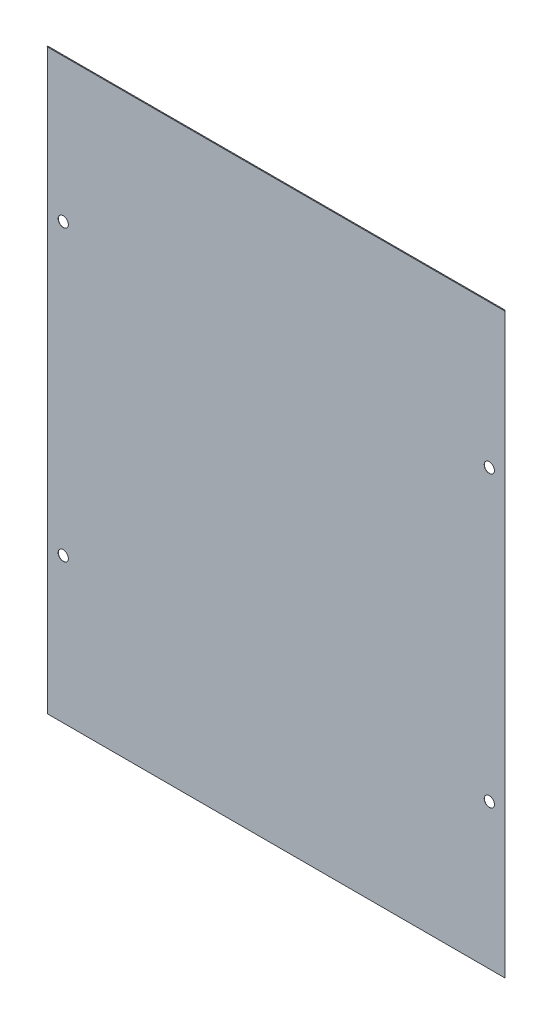
ISO-10303-21;
HEADER;
FILE_DESCRIPTION(('STEP AP214'),'2;1');
FILE_NAME('part.step','',(''),(''),'','','');
FILE_SCHEMA(('AUTOMOTIVE_DESIGN { 1 0 10303 214 1 1 1 1 }'));
ENDSEC;
DATA;
#1=APPLICATION_CONTEXT('core data for automotive mechanical design processes');
#2=APPLICATION_PROTOCOL_DEFINITION('international standard','automotive_design',2000,#1);
#3=PRODUCT_CONTEXT('',#1,'mechanical');
#4=PRODUCT('Part','Part','',(#3));
#5=PRODUCT_RELATED_PRODUCT_CATEGORY('part','',(#4));
#6=PRODUCT_DEFINITION_FORMATION('','',#4);
#7=PRODUCT_DEFINITION_CONTEXT('part definition',#1,'design');
#8=PRODUCT_DEFINITION('design','',#6,#7);
#9=PRODUCT_DEFINITION_SHAPE('','',#8);
#10=(LENGTH_UNIT() NAMED_UNIT(*) SI_UNIT(.MILLI.,.METRE.));
#11=(NAMED_UNIT(*) PLANE_ANGLE_UNIT() SI_UNIT($,.RADIAN.));
#12=(NAMED_UNIT(*) SI_UNIT($,.STERADIAN.) SOLID_ANGLE_UNIT());
#13=UNCERTAINTY_MEASURE_WITH_UNIT(LENGTH_MEASURE(1.E-05),#10,'distance_accuracy_value','');
#14=(GEOMETRIC_REPRESENTATION_CONTEXT(3) GLOBAL_UNCERTAINTY_ASSIGNED_CONTEXT((#13)) GLOBAL_UNIT_ASSIGNED_CONTEXT((#10,
#11,#12)) REPRESENTATION_CONTEXT('',''));
#15=CARTESIAN_POINT('',(0.,0.,0.));
#16=DIRECTION('',(0.,0.,1.));
#17=DIRECTION('',(1.,0.,0.));
#18=AXIS2_PLACEMENT_3D('',#15,#16,#17);
#19=CARTESIAN_POINT('',(0.,113.6448,0.06858));
#20=DIRECTION('',(0.,1.,0.));
#21=DIRECTION('',(0.,0.,1.));
#22=AXIS2_PLACEMENT_3D('',#19,#20,#21);
#23=PLANE('',#22);
#24=DIRECTION('',(1.,0.,0.));
#25=VECTOR('',#24,1.);
#26=CARTESIAN_POINT('',(0.,113.6448,0.));
#27=LINE('',#26,#25);
#28=CARTESIAN_POINT('',(-89.8724,113.6448,0.));
#29=VERTEX_POINT('',#28);
#30=CARTESIAN_POINT('',(89.8724,113.6448,0.));
#31=VERTEX_POINT('',#30);
#32=EDGE_CURVE('E155',#29,#31,#27,.T.);
#33=ORIENTED_EDGE('',*,*,#32,.F.);
#34=DIRECTION('',(0.,0.,-1.));
#35=VECTOR('',#34,1.);
#36=CARTESIAN_POINT('',(-89.8724,113.6448,0.06858));
#37=LINE('',#36,#35);
#38=CARTESIAN_POINT('',(-89.8724,113.6448,0.358180000000013));
#39=VERTEX_POINT('',#38);
#40=EDGE_CURVE('E11',#39,#29,#37,.T.);
#41=ORIENTED_EDGE('',*,*,#40,.F.);
#42=DIRECTION('',(-1.,0.,0.));
#43=VECTOR('',#42,1.);
#44=CARTESIAN_POINT('',(-89.8724,113.6448,0.358180000000013));
#45=LINE('',#44,#43);
#46=CARTESIAN_POINT('',(89.8724,113.6448,0.358180000000013));
#47=VERTEX_POINT('',#46);
#48=EDGE_CURVE('E93',#47,#39,#45,.T.);
#49=ORIENTED_EDGE('',*,*,#48,.F.);
#50=DIRECTION('',(0.,0.,-1.));
#51=VECTOR('',#50,1.);
#52=CARTESIAN_POINT('',(89.8724,113.6448,0.06858));
#53=LINE('',#52,#51);
#54=EDGE_CURVE('E96',#47,#31,#53,.T.);
#55=ORIENTED_EDGE('',*,*,#54,.T.);
#56=EDGE_LOOP('',(#33,#41,#49,#55));
#57=FACE_BOUND('',#56,.T.);
#58=ADVANCED_FACE('F39',(#57),#23,.T.);
#59=CARTESIAN_POINT('',(-89.8724,0.,0.06858));
#60=DIRECTION('',(-1.,0.,0.));
#61=DIRECTION('',(0.,0.,1.));
#62=AXIS2_PLACEMENT_3D('',#59,#60,#61);
#63=PLANE('',#62);
#64=DIRECTION('',(0.,1.,0.));
#65=VECTOR('',#64,1.);
#66=CARTESIAN_POINT('',(-89.8724,0.,0.));
#67=LINE('',#66,#65);
#68=CARTESIAN_POINT('',(-89.8724,-113.6448,0.));
#69=VERTEX_POINT('',#68);
#70=EDGE_CURVE('E161',#69,#29,#67,.T.);
#71=ORIENTED_EDGE('',*,*,#70,.F.);
#72=DIRECTION('',(0.,0.,-1.));
#73=VECTOR('',#72,1.);
#74=CARTESIAN_POINT('',(-89.8724,-113.6448,0.06858));
#75=LINE('',#74,#73);
#76=CARTESIAN_POINT('',(-89.8724,-113.6448,0.06858));
#77=VERTEX_POINT('',#76);
#78=EDGE_CURVE('E48',#77,#69,#75,.T.);
#79=ORIENTED_EDGE('',*,*,#78,.F.);
#80=DIRECTION('',(0.,1.,0.));
#81=VECTOR('',#80,1.);
#82=CARTESIAN_POINT('',(-89.8724,0.,0.06858));
#83=LINE('',#82,#81);
#84=CARTESIAN_POINT('',(-89.8724,113.5762,0.06858));
#85=VERTEX_POINT('',#84);
#86=EDGE_CURVE('E145',#77,#85,#83,.T.);
#87=ORIENTED_EDGE('',*,*,#86,.T.);
#88=DIRECTION('',(0.,0.,-1.));
#89=VECTOR('',#88,1.);
#90=CARTESIAN_POINT('',(-89.8724,113.5762,0.358180000000013));
#91=LINE('',#90,#89);
#92=CARTESIAN_POINT('',(-89.8724,113.5762,0.358180000000013));
#93=VERTEX_POINT('',#92);
#94=EDGE_CURVE('E101',#93,#85,#91,.T.);
#95=ORIENTED_EDGE('',*,*,#94,.F.);
#96=DIRECTION('',(0.,-1.,0.));
#97=VECTOR('',#96,1.);
#98=CARTESIAN_POINT('',(-89.8724,113.6448,0.358180000000013));
#99=LINE('',#98,#97);
#100=EDGE_CURVE('E136',#39,#93,#99,.T.);
#101=ORIENTED_EDGE('',*,*,#100,.F.);
#102=ORIENTED_EDGE('',*,*,#40,.T.);
#103=EDGE_LOOP('',(#71,#79,#87,#95,#101,#102));
#104=FACE_BOUND('',#103,.T.);
#105=ADVANCED_FACE('F208',(#104),#63,.T.);
#106=CARTESIAN_POINT('',(0.,-113.6448,0.06858));
#107=DIRECTION('',(0.,1.,0.));
#108=DIRECTION('',(0.,0.,1.));
#109=AXIS2_PLACEMENT_3D('',#106,#107,#108);
#110=PLANE('',#109);
#111=DIRECTION('',(1.,0.,0.));
#112=VECTOR('',#111,1.);
#113=CARTESIAN_POINT('',(0.,-113.6448,0.));
#114=LINE('',#113,#112);
#115=CARTESIAN_POINT('',(89.8724,-113.6448,0.));
#116=VERTEX_POINT('',#115);
#117=EDGE_CURVE('E164',#69,#116,#114,.T.);
#118=ORIENTED_EDGE('',*,*,#117,.T.);
#119=DIRECTION('',(0.,0.,-1.));
#120=VECTOR('',#119,1.);
#121=CARTESIAN_POINT('',(89.8724,-113.6448,0.06858));
#122=LINE('',#121,#120);
#123=CARTESIAN_POINT('',(89.8724,-113.6448,0.06858));
#124=VERTEX_POINT('',#123);
#125=EDGE_CURVE('E113',#124,#116,#122,.T.);
#126=ORIENTED_EDGE('',*,*,#125,.F.);
#127=DIRECTION('',(1.,0.,0.));
#128=VECTOR('',#127,1.);
#129=CARTESIAN_POINT('',(0.,-113.6448,0.06858));
#130=LINE('',#129,#128);
#131=EDGE_CURVE('E158',#77,#124,#130,.T.);
#132=ORIENTED_EDGE('',*,*,#131,.F.);
#133=ORIENTED_EDGE('',*,*,#78,.T.);
#134=EDGE_LOOP('',(#118,#126,#132,#133));
#135=FACE_BOUND('',#134,.T.);
#136=ADVANCED_FACE('F213',(#135),#110,.F.);
#137=CARTESIAN_POINT('',(-83.71996894,56.98616943,0.06858));
#138=DIRECTION('',(0.,0.,-1.));
#139=DIRECTION('',(-1.,0.,0.));
#140=AXIS2_PLACEMENT_3D('',#137,#138,#139);
#141=CYLINDRICAL_SURFACE('',#140,2.);
#142=CARTESIAN_POINT('',(-83.71996894,56.98616943,0.06858));
#143=DIRECTION('',(0.,0.,1.));
#144=DIRECTION('',(1.,0.,0.));
#145=AXIS2_PLACEMENT_3D('',#142,#143,#144);
#146=CIRCLE('',#145,2.);
#147=CARTESIAN_POINT('',(-81.71996894,56.98616943,0.06858));
#148=VERTEX_POINT('',#147);
#149=EDGE_CURVE('E170',#148,#148,#146,.T.);
#150=ORIENTED_EDGE('',*,*,#149,.T.);
#151=EDGE_LOOP('',(#150));
#152=FACE_BOUND('',#151,.T.);
#153=CARTESIAN_POINT('',(-83.71996894,56.98616943,0.));
#154=DIRECTION('',(0.,0.,1.));
#155=DIRECTION('',(1.,0.,0.));
#156=AXIS2_PLACEMENT_3D('',#153,#154,#155);
#157=CIRCLE('',#156,2.);
#158=CARTESIAN_POINT('',(-81.71996894,56.98616943,0.));
#159=VERTEX_POINT('',#158);
#160=EDGE_CURVE('E150',#159,#159,#157,.T.);
#161=ORIENTED_EDGE('',*,*,#160,.F.);
#162=EDGE_LOOP('',(#161));
#163=FACE_BOUND('',#162,.T.);
#164=ADVANCED_FACE('F215',(#152,#163),#141,.F.);
#165=CARTESIAN_POINT('',(-83.71996894,-56.66618171,0.06858));
#166=DIRECTION('',(0.,0.,-1.));
#167=DIRECTION('',(-1.,0.,0.));
#168=AXIS2_PLACEMENT_3D('',#165,#166,#167);
#169=CYLINDRICAL_SURFACE('',#168,2.);
#170=CARTESIAN_POINT('',(-83.71996894,-56.66618171,0.06858));
#171=DIRECTION('',(0.,0.,1.));
#172=DIRECTION('',(1.,0.,0.));
#173=AXIS2_PLACEMENT_3D('',#170,#171,#172);
#174=CIRCLE('',#173,2.);
#175=CARTESIAN_POINT('',(-81.71996894,-56.66618171,0.06858));
#176=VERTEX_POINT('',#175);
#177=EDGE_CURVE('E141',#176,#176,#174,.T.);
#178=ORIENTED_EDGE('',*,*,#177,.T.);
#179=EDGE_LOOP('',(#178));
#180=FACE_BOUND('',#179,.T.);
#181=CARTESIAN_POINT('',(-83.71996894,-56.66618171,0.));
#182=DIRECTION('',(0.,0.,1.));
#183=DIRECTION('',(1.,0.,0.));
#184=AXIS2_PLACEMENT_3D('',#181,#182,#183);
#185=CIRCLE('',#184,2.);
#186=CARTESIAN_POINT('',(-81.71996894,-56.66618171,0.));
#187=VERTEX_POINT('',#186);
#188=EDGE_CURVE('E147',#187,#187,#185,.T.);
#189=ORIENTED_EDGE('',*,*,#188,.F.);
#190=EDGE_LOOP('',(#189));
#191=FACE_BOUND('',#190,.T.);
#192=ADVANCED_FACE('F41',(#180,#191),#169,.F.);
#193=CARTESIAN_POINT('',(0.,0.,0.06858));
#194=DIRECTION('',(0.,0.,1.));
#195=DIRECTION('',(1.,0.,0.));
#196=AXIS2_PLACEMENT_3D('',#193,#194,#195);
#197=PLANE('',#196);
#198=DIRECTION('',(0.,1.,0.));
#199=VECTOR('',#198,1.);
#200=CARTESIAN_POINT('',(89.8724,0.,0.06858));
#201=LINE('',#200,#199);
#202=CARTESIAN_POINT('',(89.8724,113.5762,0.06858));
#203=VERTEX_POINT('',#202);
#204=EDGE_CURVE('E114',#124,#203,#201,.T.);
#205=ORIENTED_EDGE('',*,*,#204,.T.);
#206=DIRECTION('',(1.,0.,0.));
#207=VECTOR('',#206,1.);
#208=CARTESIAN_POINT('',(-89.8724,113.5762,0.0685800000000125));
#209=LINE('',#208,#207);
#210=EDGE_CURVE('E56',#85,#203,#209,.T.);
#211=ORIENTED_EDGE('',*,*,#210,.F.);
#212=ORIENTED_EDGE('',*,*,#86,.F.);
#213=ORIENTED_EDGE('',*,*,#131,.T.);
#214=EDGE_LOOP('',(#205,#211,#212,#213));
#215=FACE_BOUND('',#214,.T.);
#216=ORIENTED_EDGE('',*,*,#177,.F.);
#217=EDGE_LOOP('',(#216));
#218=FACE_BOUND('',#217,.T.);
#219=ORIENTED_EDGE('',*,*,#149,.F.);
#220=EDGE_LOOP('',(#219));
#221=FACE_BOUND('',#220,.T.);
#222=CARTESIAN_POINT('',(83.71996894,-56.66618171,0.06858));
#223=DIRECTION('',(0.,0.,-1.));
#224=DIRECTION('',(-1.,0.,0.));
#225=AXIS2_PLACEMENT_3D('',#222,#223,#224);
#226=CIRCLE('',#225,2.);
#227=CARTESIAN_POINT('',(81.71996894,-56.66618171,0.06858));
#228=VERTEX_POINT('',#227);
#229=EDGE_CURVE('E122',#228,#228,#226,.T.);
#230=ORIENTED_EDGE('',*,*,#229,.T.);
#231=EDGE_LOOP('',(#230));
#232=FACE_BOUND('',#231,.T.);
#233=CARTESIAN_POINT('',(83.71996894,56.98616943,0.06858));
#234=DIRECTION('',(0.,0.,-1.));
#235=DIRECTION('',(-1.,0.,0.));
#236=AXIS2_PLACEMENT_3D('',#233,#234,#235);
#237=CIRCLE('',#236,2.);
#238=CARTESIAN_POINT('',(81.71996894,56.98616943,0.06858));
#239=VERTEX_POINT('',#238);
#240=EDGE_CURVE('E125',#239,#239,#237,.T.);
#241=ORIENTED_EDGE('',*,*,#240,.T.);
#242=EDGE_LOOP('',(#241));
#243=FACE_BOUND('',#242,.T.);
#244=ADVANCED_FACE('F181',(#215,#218,#221,#232,#243),#197,.T.);
#245=CARTESIAN_POINT('',(0.,0.,0.));
#246=DIRECTION('',(0.,0.,1.));
#247=DIRECTION('',(1.,0.,0.));
#248=AXIS2_PLACEMENT_3D('',#245,#246,#247);
#249=PLANE('',#248);
#250=ORIENTED_EDGE('',*,*,#188,.T.);
#251=EDGE_LOOP('',(#250));
#252=FACE_BOUND('',#251,.T.);
#253=ORIENTED_EDGE('',*,*,#160,.T.);
#254=EDGE_LOOP('',(#253));
#255=FACE_BOUND('',#254,.T.);
#256=ORIENTED_EDGE('',*,*,#32,.T.);
#257=DIRECTION('',(0.,1.,0.));
#258=VECTOR('',#257,1.);
#259=CARTESIAN_POINT('',(89.8724,0.,0.));
#260=LINE('',#259,#258);
#261=EDGE_CURVE('E112',#116,#31,#260,.T.);
#262=ORIENTED_EDGE('',*,*,#261,.F.);
#263=ORIENTED_EDGE('',*,*,#117,.F.);
#264=ORIENTED_EDGE('',*,*,#70,.T.);
#265=EDGE_LOOP('',(#256,#262,#263,#264));
#266=FACE_BOUND('',#265,.T.);
#267=CARTESIAN_POINT('',(83.71996894,-56.66618171,0.));
#268=DIRECTION('',(0.,0.,-1.));
#269=DIRECTION('',(-1.,0.,0.));
#270=AXIS2_PLACEMENT_3D('',#267,#268,#269);
#271=CIRCLE('',#270,2.);
#272=CARTESIAN_POINT('',(81.71996894,-56.66618171,0.));
#273=VERTEX_POINT('',#272);
#274=EDGE_CURVE('E119',#273,#273,#271,.T.);
#275=ORIENTED_EDGE('',*,*,#274,.F.);
#276=EDGE_LOOP('',(#275));
#277=FACE_BOUND('',#276,.T.);
#278=CARTESIAN_POINT('',(83.71996894,56.98616943,0.));
#279=DIRECTION('',(0.,0.,-1.));
#280=DIRECTION('',(-1.,0.,0.));
#281=AXIS2_PLACEMENT_3D('',#278,#279,#280);
#282=CIRCLE('',#281,2.);
#283=CARTESIAN_POINT('',(81.71996894,56.98616943,0.));
#284=VERTEX_POINT('',#283);
#285=EDGE_CURVE('E131',#284,#284,#282,.T.);
#286=ORIENTED_EDGE('',*,*,#285,.F.);
#287=EDGE_LOOP('',(#286));
#288=FACE_BOUND('',#287,.T.);
#289=ADVANCED_FACE('F184',(#252,#255,#266,#277,#288),#249,.F.);
#290=CARTESIAN_POINT('',(-89.8724,113.5762,0.358180000000013));
#291=DIRECTION('',(0.,1.,0.));
#292=DIRECTION('',(-1.,0.,0.));
#293=AXIS2_PLACEMENT_3D('',#290,#291,#292);
#294=PLANE('',#293);
#295=ORIENTED_EDGE('',*,*,#210,.T.);
#296=DIRECTION('',(0.,0.,-1.));
#297=VECTOR('',#296,1.);
#298=CARTESIAN_POINT('',(89.8724,113.5762,0.358180000000013));
#299=LINE('',#298,#297);
#300=CARTESIAN_POINT('',(89.8724,113.5762,0.358180000000013));
#301=VERTEX_POINT('',#300);
#302=EDGE_CURVE('E117',#301,#203,#299,.T.);
#303=ORIENTED_EDGE('',*,*,#302,.F.);
#304=DIRECTION('',(1.,0.,0.));
#305=VECTOR('',#304,1.);
#306=CARTESIAN_POINT('',(-89.8724,113.5762,0.358180000000013));
#307=LINE('',#306,#305);
#308=EDGE_CURVE('E102',#93,#301,#307,.T.);
#309=ORIENTED_EDGE('',*,*,#308,.F.);
#310=ORIENTED_EDGE('',*,*,#94,.T.);
#311=EDGE_LOOP('',(#295,#303,#309,#310));
#312=FACE_BOUND('',#311,.T.);
#313=ADVANCED_FACE('F199',(#312),#294,.F.);
#314=CARTESIAN_POINT('',(0.,0.,0.358180000000013));
#315=DIRECTION('',(0.,0.,1.));
#316=DIRECTION('',(1.,0.,0.));
#317=AXIS2_PLACEMENT_3D('',#314,#315,#316);
#318=PLANE('',#317);
#319=ORIENTED_EDGE('',*,*,#100,.T.);
#320=ORIENTED_EDGE('',*,*,#308,.T.);
#321=DIRECTION('',(0.,-1.,0.));
#322=VECTOR('',#321,1.);
#323=CARTESIAN_POINT('',(89.8724,113.6448,0.358180000000013));
#324=LINE('',#323,#322);
#325=EDGE_CURVE('E109',#47,#301,#324,.T.);
#326=ORIENTED_EDGE('',*,*,#325,.F.);
#327=ORIENTED_EDGE('',*,*,#48,.T.);
#328=EDGE_LOOP('',(#319,#320,#326,#327));
#329=FACE_BOUND('',#328,.T.);
#330=ADVANCED_FACE('F116',(#329),#318,.T.);
#331=CARTESIAN_POINT('',(83.71996894,56.98616943,0.06858));
#332=DIRECTION('',(0.,0.,-1.));
#333=DIRECTION('',(-1.,0.,0.));
#334=AXIS2_PLACEMENT_3D('',#331,#332,#333);
#335=CYLINDRICAL_SURFACE('',#334,2.);
#336=ORIENTED_EDGE('',*,*,#240,.F.);
#337=EDGE_LOOP('',(#336));
#338=FACE_BOUND('',#337,.T.);
#339=ORIENTED_EDGE('',*,*,#285,.T.);
#340=EDGE_LOOP('',(#339));
#341=FACE_BOUND('',#340,.T.);
#342=ADVANCED_FACE('F191',(#338,#341),#335,.F.);
#343=CARTESIAN_POINT('',(83.71996894,-56.66618171,0.06858));
#344=DIRECTION('',(0.,0.,-1.));
#345=DIRECTION('',(-1.,0.,0.));
#346=AXIS2_PLACEMENT_3D('',#343,#344,#345);
#347=CYLINDRICAL_SURFACE('',#346,2.);
#348=ORIENTED_EDGE('',*,*,#229,.F.);
#349=EDGE_LOOP('',(#348));
#350=FACE_BOUND('',#349,.T.);
#351=ORIENTED_EDGE('',*,*,#274,.T.);
#352=EDGE_LOOP('',(#351));
#353=FACE_BOUND('',#352,.T.);
#354=ADVANCED_FACE('F194',(#350,#353),#347,.F.);
#355=CARTESIAN_POINT('',(89.8724,0.,0.06858));
#356=DIRECTION('',(-1.,0.,0.));
#357=DIRECTION('',(0.,0.,1.));
#358=AXIS2_PLACEMENT_3D('',#355,#356,#357);
#359=PLANE('',#358);
#360=ORIENTED_EDGE('',*,*,#261,.T.);
#361=ORIENTED_EDGE('',*,*,#54,.F.);
#362=ORIENTED_EDGE('',*,*,#325,.T.);
#363=ORIENTED_EDGE('',*,*,#302,.T.);
#364=ORIENTED_EDGE('',*,*,#204,.F.);
#365=ORIENTED_EDGE('',*,*,#125,.T.);
#366=EDGE_LOOP('',(#360,#361,#362,#363,#364,#365));
#367=FACE_BOUND('',#366,.T.);
#368=ADVANCED_FACE('F107',(#367),#359,.F.);
#369=CLOSED_SHELL('',(#58,#105,#136,#164,#192,#244,#289,#313,#330,#342,#354,#368));
#370=MANIFOLD_SOLID_BREP('B2',#369);
#371=ADVANCED_BREP_SHAPE_REPRESENTATION('',(#18,#370),#14);
#372=SHAPE_DEFINITION_REPRESENTATION(#9,#371);
ENDSEC;
END-ISO-10303-21;
